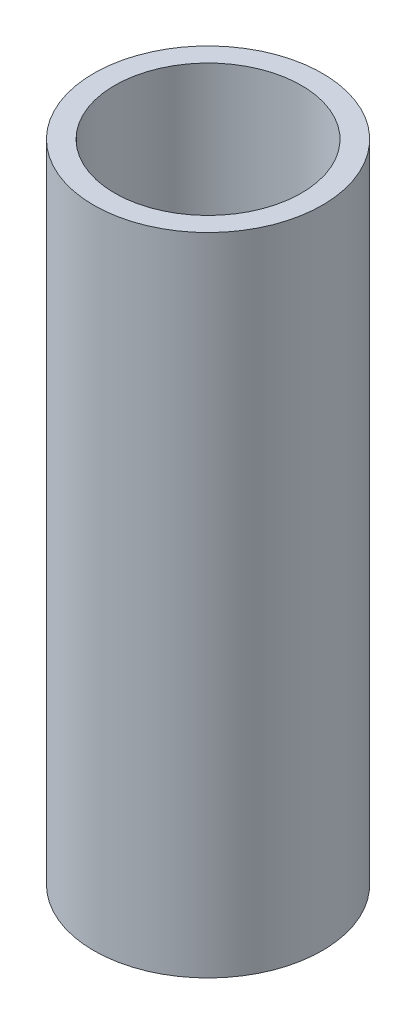
ISO-10303-21;
HEADER;
FILE_DESCRIPTION(('STEP AP214'),'2;1');
FILE_NAME('part.step','',(''),(''),'','','');
FILE_SCHEMA(('AUTOMOTIVE_DESIGN { 1 0 10303 214 1 1 1 1 }'));
ENDSEC;
DATA;
#1=APPLICATION_CONTEXT('core data for automotive mechanical design processes');
#2=APPLICATION_PROTOCOL_DEFINITION('international standard','automotive_design',2000,#1);
#3=PRODUCT_CONTEXT('',#1,'mechanical');
#4=PRODUCT('Part','Part','',(#3));
#5=PRODUCT_RELATED_PRODUCT_CATEGORY('part','',(#4));
#6=PRODUCT_DEFINITION_FORMATION('','',#4);
#7=PRODUCT_DEFINITION_CONTEXT('part definition',#1,'design');
#8=PRODUCT_DEFINITION('design','',#6,#7);
#9=PRODUCT_DEFINITION_SHAPE('','',#8);
#10=(LENGTH_UNIT() NAMED_UNIT(*) SI_UNIT(.MILLI.,.METRE.));
#11=(NAMED_UNIT(*) PLANE_ANGLE_UNIT() SI_UNIT($,.RADIAN.));
#12=(NAMED_UNIT(*) SI_UNIT($,.STERADIAN.) SOLID_ANGLE_UNIT());
#13=UNCERTAINTY_MEASURE_WITH_UNIT(LENGTH_MEASURE(1.E-05),#10,'distance_accuracy_value','');
#14=(GEOMETRIC_REPRESENTATION_CONTEXT(3) GLOBAL_UNCERTAINTY_ASSIGNED_CONTEXT((#13)) GLOBAL_UNIT_ASSIGNED_CONTEXT((#10,
#11,#12)) REPRESENTATION_CONTEXT('',''));
#15=CARTESIAN_POINT('',(0.,0.,0.));
#16=DIRECTION('',(0.,0.,1.));
#17=DIRECTION('',(1.,0.,0.));
#18=AXIS2_PLACEMENT_3D('',#15,#16,#17);
#19=CARTESIAN_POINT('',(0.,338.922958863904,0.));
#20=DIRECTION('',(0.,-1.,0.));
#21=DIRECTION('',(0.,0.,-1.));
#22=AXIS2_PLACEMENT_3D('',#19,#20,#21);
#23=CYLINDRICAL_SURFACE('',#22,60.);
#24=CARTESIAN_POINT('',(0.,338.922958863904,0.));
#25=DIRECTION('',(0.,1.,0.));
#26=DIRECTION('',(0.,0.,1.));
#27=AXIS2_PLACEMENT_3D('',#24,#25,#26);
#28=CIRCLE('',#27,60.);
#29=CARTESIAN_POINT('',(0.,338.922958863904,60.));
#30=VERTEX_POINT('',#29);
#31=EDGE_CURVE('E10',#30,#30,#28,.T.);
#32=ORIENTED_EDGE('',*,*,#31,.F.);
#33=EDGE_LOOP('',(#32));
#34=FACE_BOUND('',#33,.T.);
#35=CARTESIAN_POINT('',(0.,0.,0.));
#36=DIRECTION('',(0.,1.,0.));
#37=DIRECTION('',(0.,0.,1.));
#38=AXIS2_PLACEMENT_3D('',#35,#36,#37);
#39=CIRCLE('',#38,60.);
#40=CARTESIAN_POINT('',(0.,0.,60.));
#41=VERTEX_POINT('',#40);
#42=EDGE_CURVE('E37',#41,#41,#39,.T.);
#43=ORIENTED_EDGE('',*,*,#42,.T.);
#44=EDGE_LOOP('',(#43));
#45=FACE_BOUND('',#44,.T.);
#46=ADVANCED_FACE('F40',(#34,#45),#23,.T.);
#47=CARTESIAN_POINT('',(0.,338.922958863904,0.));
#48=DIRECTION('',(0.,1.,0.));
#49=DIRECTION('',(0.,0.,1.));
#50=AXIS2_PLACEMENT_3D('',#47,#48,#49);
#51=PLANE('',#50);
#52=CARTESIAN_POINT('',(0.,338.922958863904,0.));
#53=DIRECTION('',(0.,1.,0.));
#54=DIRECTION('',(0.,0.,1.));
#55=AXIS2_PLACEMENT_3D('',#52,#53,#54);
#56=CIRCLE('',#55,49.0147503387847);
#57=CARTESIAN_POINT('',(0.,338.922958863904,49.0147503387847));
#58=VERTEX_POINT('',#57);
#59=EDGE_CURVE('E50',#58,#58,#56,.T.);
#60=ORIENTED_EDGE('',*,*,#59,.F.);
#61=EDGE_LOOP('',(#60));
#62=FACE_BOUND('',#61,.T.);
#63=ORIENTED_EDGE('',*,*,#31,.T.);
#64=EDGE_LOOP('',(#63));
#65=FACE_BOUND('',#64,.T.);
#66=ADVANCED_FACE('F59',(#62,#65),#51,.T.);
#67=CARTESIAN_POINT('',(0.,0.,0.));
#68=DIRECTION('',(0.,1.,0.));
#69=DIRECTION('',(0.,0.,1.));
#70=AXIS2_PLACEMENT_3D('',#67,#68,#69);
#71=PLANE('',#70);
#72=CARTESIAN_POINT('',(0.,0.,0.));
#73=DIRECTION('',(0.,1.,0.));
#74=DIRECTION('',(0.,0.,1.));
#75=AXIS2_PLACEMENT_3D('',#72,#73,#74);
#76=CIRCLE('',#75,49.0147503387847);
#77=CARTESIAN_POINT('',(0.,0.,49.0147503387847));
#78=VERTEX_POINT('',#77);
#79=EDGE_CURVE('E47',#78,#78,#76,.T.);
#80=ORIENTED_EDGE('',*,*,#79,.T.);
#81=EDGE_LOOP('',(#80));
#82=FACE_BOUND('',#81,.T.);
#83=ORIENTED_EDGE('',*,*,#42,.F.);
#84=EDGE_LOOP('',(#83));
#85=FACE_BOUND('',#84,.T.);
#86=ADVANCED_FACE('F58',(#82,#85),#71,.F.);
#87=CARTESIAN_POINT('',(0.,338.922958863904,0.));
#88=DIRECTION('',(0.,-1.,0.));
#89=DIRECTION('',(0.,0.,-1.));
#90=AXIS2_PLACEMENT_3D('',#87,#88,#89);
#91=CYLINDRICAL_SURFACE('',#90,49.0147503387847);
#92=ORIENTED_EDGE('',*,*,#59,.T.);
#93=EDGE_LOOP('',(#92));
#94=FACE_BOUND('',#93,.T.);
#95=ORIENTED_EDGE('',*,*,#79,.F.);
#96=EDGE_LOOP('',(#95));
#97=FACE_BOUND('',#96,.T.);
#98=ADVANCED_FACE('F54',(#94,#97),#91,.F.);
#99=CLOSED_SHELL('',(#46,#66,#86,#98));
#100=MANIFOLD_SOLID_BREP('B2',#99);
#101=ADVANCED_BREP_SHAPE_REPRESENTATION('',(#18,#100),#14);
#102=SHAPE_DEFINITION_REPRESENTATION(#9,#101);
ENDSEC;
END-ISO-10303-21;
